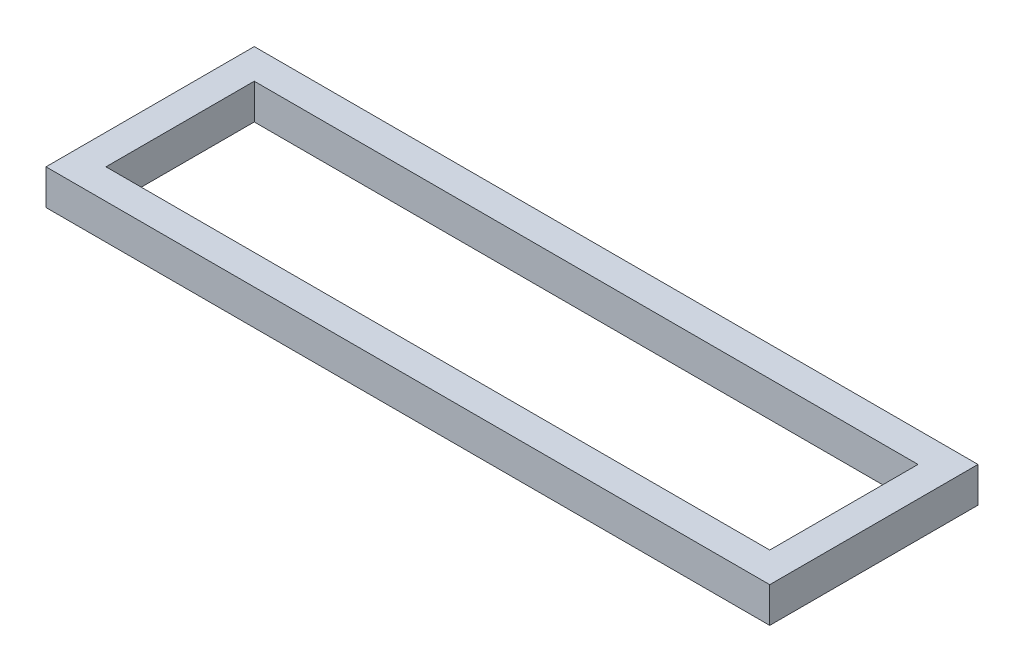
ISO-10303-21;
HEADER;
FILE_DESCRIPTION(('STEP AP214'),'2;1');
FILE_NAME('part.step','',(''),(''),'','','');
FILE_SCHEMA(('AUTOMOTIVE_DESIGN { 1 0 10303 214 1 1 1 1 }'));
ENDSEC;
DATA;
#1=APPLICATION_CONTEXT('core data for automotive mechanical design processes');
#2=APPLICATION_PROTOCOL_DEFINITION('international standard','automotive_design',2000,#1);
#3=PRODUCT_CONTEXT('',#1,'mechanical');
#4=PRODUCT('Part','Part','',(#3));
#5=PRODUCT_RELATED_PRODUCT_CATEGORY('part','',(#4));
#6=PRODUCT_DEFINITION_FORMATION('','',#4);
#7=PRODUCT_DEFINITION_CONTEXT('part definition',#1,'design');
#8=PRODUCT_DEFINITION('design','',#6,#7);
#9=PRODUCT_DEFINITION_SHAPE('','',#8);
#10=(LENGTH_UNIT() NAMED_UNIT(*) SI_UNIT(.MILLI.,.METRE.));
#11=(NAMED_UNIT(*) PLANE_ANGLE_UNIT() SI_UNIT($,.RADIAN.));
#12=(NAMED_UNIT(*) SI_UNIT($,.STERADIAN.) SOLID_ANGLE_UNIT());
#13=UNCERTAINTY_MEASURE_WITH_UNIT(LENGTH_MEASURE(1.E-05),#10,'distance_accuracy_value','');
#14=(GEOMETRIC_REPRESENTATION_CONTEXT(3) GLOBAL_UNCERTAINTY_ASSIGNED_CONTEXT((#13)) GLOBAL_UNIT_ASSIGNED_CONTEXT((#10,
#11,#12)) REPRESENTATION_CONTEXT('',''));
#15=CARTESIAN_POINT('',(0.,0.,0.));
#16=DIRECTION('',(0.,0.,1.));
#17=DIRECTION('',(1.,0.,0.));
#18=AXIS2_PLACEMENT_3D('',#15,#16,#17);
#19=CARTESIAN_POINT('',(-488.125,47.625,0.));
#20=DIRECTION('',(-1.,0.,0.));
#21=DIRECTION('',(0.,0.,1.));
#22=AXIS2_PLACEMENT_3D('',#19,#20,#21);
#23=PLANE('',#22);
#24=DIRECTION('',(0.,0.,-1.));
#25=VECTOR('',#24,1.);
#26=CARTESIAN_POINT('',(-488.125,0.,0.));
#27=LINE('',#26,#25);
#28=CARTESIAN_POINT('',(-488.125,0.,140.4625));
#29=VERTEX_POINT('',#28);
#30=CARTESIAN_POINT('',(-488.125,0.,-140.4625));
#31=VERTEX_POINT('',#30);
#32=EDGE_CURVE('E150',#29,#31,#27,.T.);
#33=ORIENTED_EDGE('',*,*,#32,.F.);
#34=DIRECTION('',(0.,-1.,0.));
#35=VECTOR('',#34,1.);
#36=CARTESIAN_POINT('',(-488.125,47.625,140.4625));
#37=LINE('',#36,#35);
#38=CARTESIAN_POINT('',(-488.125,47.625,140.4625));
#39=VERTEX_POINT('',#38);
#40=EDGE_CURVE('E11',#39,#29,#37,.T.);
#41=ORIENTED_EDGE('',*,*,#40,.F.);
#42=DIRECTION('',(0.,0.,-1.));
#43=VECTOR('',#42,1.);
#44=CARTESIAN_POINT('',(-488.125,47.625,0.));
#45=LINE('',#44,#43);
#46=CARTESIAN_POINT('',(-488.125,47.625,-140.4625));
#47=VERTEX_POINT('',#46);
#48=EDGE_CURVE('E121',#39,#47,#45,.T.);
#49=ORIENTED_EDGE('',*,*,#48,.T.);
#50=DIRECTION('',(0.,-1.,0.));
#51=VECTOR('',#50,1.);
#52=CARTESIAN_POINT('',(-488.125,47.625,-140.4625));
#53=LINE('',#52,#51);
#54=EDGE_CURVE('E55',#47,#31,#53,.T.);
#55=ORIENTED_EDGE('',*,*,#54,.T.);
#56=EDGE_LOOP('',(#33,#41,#49,#55));
#57=FACE_BOUND('',#56,.T.);
#58=ADVANCED_FACE('F36',(#57),#23,.T.);
#59=CARTESIAN_POINT('',(0.,47.625,140.4625));
#60=DIRECTION('',(0.,0.,-1.));
#61=DIRECTION('',(-1.,0.,0.));
#62=AXIS2_PLACEMENT_3D('',#59,#60,#61);
#63=PLANE('',#62);
#64=DIRECTION('',(1.,0.,0.));
#65=VECTOR('',#64,1.);
#66=CARTESIAN_POINT('',(0.,0.,140.4625));
#67=LINE('',#66,#65);
#68=CARTESIAN_POINT('',(488.125,0.,140.4625));
#69=VERTEX_POINT('',#68);
#70=EDGE_CURVE('E126',#29,#69,#67,.T.);
#71=ORIENTED_EDGE('',*,*,#70,.T.);
#72=DIRECTION('',(0.,-1.,0.));
#73=VECTOR('',#72,1.);
#74=CARTESIAN_POINT('',(488.125,47.625,140.4625));
#75=LINE('',#74,#73);
#76=CARTESIAN_POINT('',(488.125,47.625,140.4625));
#77=VERTEX_POINT('',#76);
#78=EDGE_CURVE('E46',#77,#69,#75,.T.);
#79=ORIENTED_EDGE('',*,*,#78,.F.);
#80=DIRECTION('',(1.,0.,0.));
#81=VECTOR('',#80,1.);
#82=CARTESIAN_POINT('',(0.,47.625,140.4625));
#83=LINE('',#82,#81);
#84=EDGE_CURVE('E116',#39,#77,#83,.T.);
#85=ORIENTED_EDGE('',*,*,#84,.F.);
#86=ORIENTED_EDGE('',*,*,#40,.T.);
#87=EDGE_LOOP('',(#71,#79,#85,#86));
#88=FACE_BOUND('',#87,.T.);
#89=ADVANCED_FACE('F124',(#88),#63,.F.);
#90=CARTESIAN_POINT('',(488.125,47.625,0.));
#91=DIRECTION('',(-1.,0.,0.));
#92=DIRECTION('',(0.,0.,1.));
#93=AXIS2_PLACEMENT_3D('',#90,#91,#92);
#94=PLANE('',#93);
#95=DIRECTION('',(0.,0.,-1.));
#96=VECTOR('',#95,1.);
#97=CARTESIAN_POINT('',(488.125,0.,0.));
#98=LINE('',#97,#96);
#99=CARTESIAN_POINT('',(488.125,0.,-140.4625));
#100=VERTEX_POINT('',#99);
#101=EDGE_CURVE('E147',#69,#100,#98,.T.);
#102=ORIENTED_EDGE('',*,*,#101,.T.);
#103=DIRECTION('',(0.,-1.,0.));
#104=VECTOR('',#103,1.);
#105=CARTESIAN_POINT('',(488.125,47.625,-140.4625));
#106=LINE('',#105,#104);
#107=CARTESIAN_POINT('',(488.125,47.625,-140.4625));
#108=VERTEX_POINT('',#107);
#109=EDGE_CURVE('E81',#108,#100,#106,.T.);
#110=ORIENTED_EDGE('',*,*,#109,.F.);
#111=DIRECTION('',(0.,0.,-1.));
#112=VECTOR('',#111,1.);
#113=CARTESIAN_POINT('',(488.125,47.625,0.));
#114=LINE('',#113,#112);
#115=EDGE_CURVE('E108',#77,#108,#114,.T.);
#116=ORIENTED_EDGE('',*,*,#115,.F.);
#117=ORIENTED_EDGE('',*,*,#78,.T.);
#118=EDGE_LOOP('',(#102,#110,#116,#117));
#119=FACE_BOUND('',#118,.T.);
#120=ADVANCED_FACE('F110',(#119),#94,.F.);
#121=CARTESIAN_POINT('',(447.675,47.625,0.));
#122=DIRECTION('',(-1.,0.,0.));
#123=DIRECTION('',(0.,0.,1.));
#124=AXIS2_PLACEMENT_3D('',#121,#122,#123);
#125=PLANE('',#124);
#126=DIRECTION('',(0.,0.,-1.));
#127=VECTOR('',#126,1.);
#128=CARTESIAN_POINT('',(447.675,0.,0.));
#129=LINE('',#128,#127);
#130=CARTESIAN_POINT('',(447.675,0.,100.0125));
#131=VERTEX_POINT('',#130);
#132=CARTESIAN_POINT('',(447.675,0.,-100.0125));
#133=VERTEX_POINT('',#132);
#134=EDGE_CURVE('E160',#131,#133,#129,.T.);
#135=ORIENTED_EDGE('',*,*,#134,.F.);
#136=DIRECTION('',(0.,-1.,0.));
#137=VECTOR('',#136,1.);
#138=CARTESIAN_POINT('',(447.675,47.625,100.0125));
#139=LINE('',#138,#137);
#140=CARTESIAN_POINT('',(447.675,47.625,100.0125));
#141=VERTEX_POINT('',#140);
#142=EDGE_CURVE('E40',#141,#131,#139,.T.);
#143=ORIENTED_EDGE('',*,*,#142,.F.);
#144=DIRECTION('',(0.,0.,-1.));
#145=VECTOR('',#144,1.);
#146=CARTESIAN_POINT('',(447.675,47.625,0.));
#147=LINE('',#146,#145);
#148=CARTESIAN_POINT('',(447.675,47.625,-100.0125));
#149=VERTEX_POINT('',#148);
#150=EDGE_CURVE('E146',#141,#149,#147,.T.);
#151=ORIENTED_EDGE('',*,*,#150,.T.);
#152=DIRECTION('',(0.,-1.,0.));
#153=VECTOR('',#152,1.);
#154=CARTESIAN_POINT('',(447.675,47.625,-100.0125));
#155=LINE('',#154,#153);
#156=EDGE_CURVE('E131',#149,#133,#155,.T.);
#157=ORIENTED_EDGE('',*,*,#156,.T.);
#158=EDGE_LOOP('',(#135,#143,#151,#157));
#159=FACE_BOUND('',#158,.T.);
#160=ADVANCED_FACE('F38',(#159),#125,.T.);
#161=CARTESIAN_POINT('',(0.,47.625,100.0125));
#162=DIRECTION('',(0.,0.,-1.));
#163=DIRECTION('',(-1.,0.,0.));
#164=AXIS2_PLACEMENT_3D('',#161,#162,#163);
#165=PLANE('',#164);
#166=DIRECTION('',(1.,0.,0.));
#167=VECTOR('',#166,1.);
#168=CARTESIAN_POINT('',(0.,0.,100.0125));
#169=LINE('',#168,#167);
#170=CARTESIAN_POINT('',(-447.675,0.,100.0125));
#171=VERTEX_POINT('',#170);
#172=EDGE_CURVE('E157',#171,#131,#169,.T.);
#173=ORIENTED_EDGE('',*,*,#172,.F.);
#174=DIRECTION('',(0.,-1.,0.));
#175=VECTOR('',#174,1.);
#176=CARTESIAN_POINT('',(-447.675,47.625,100.0125));
#177=LINE('',#176,#175);
#178=CARTESIAN_POINT('',(-447.675,47.625,100.0125));
#179=VERTEX_POINT('',#178);
#180=EDGE_CURVE('E135',#179,#171,#177,.T.);
#181=ORIENTED_EDGE('',*,*,#180,.F.);
#182=DIRECTION('',(1.,0.,0.));
#183=VECTOR('',#182,1.);
#184=CARTESIAN_POINT('',(0.,47.625,100.0125));
#185=LINE('',#184,#183);
#186=EDGE_CURVE('E169',#179,#141,#185,.T.);
#187=ORIENTED_EDGE('',*,*,#186,.T.);
#188=ORIENTED_EDGE('',*,*,#142,.T.);
#189=EDGE_LOOP('',(#173,#181,#187,#188));
#190=FACE_BOUND('',#189,.T.);
#191=ADVANCED_FACE('F175',(#190),#165,.T.);
#192=CARTESIAN_POINT('',(-447.675,47.625,0.));
#193=DIRECTION('',(-1.,0.,0.));
#194=DIRECTION('',(0.,0.,1.));
#195=AXIS2_PLACEMENT_3D('',#192,#193,#194);
#196=PLANE('',#195);
#197=DIRECTION('',(0.,0.,-1.));
#198=VECTOR('',#197,1.);
#199=CARTESIAN_POINT('',(-447.675,0.,0.));
#200=LINE('',#199,#198);
#201=CARTESIAN_POINT('',(-447.675,0.,-100.0125));
#202=VERTEX_POINT('',#201);
#203=EDGE_CURVE('E155',#171,#202,#200,.T.);
#204=ORIENTED_EDGE('',*,*,#203,.T.);
#205=DIRECTION('',(0.,-1.,0.));
#206=VECTOR('',#205,1.);
#207=CARTESIAN_POINT('',(-447.675,47.625,-100.0125));
#208=LINE('',#207,#206);
#209=CARTESIAN_POINT('',(-447.675,47.625,-100.0125));
#210=VERTEX_POINT('',#209);
#211=EDGE_CURVE('E133',#210,#202,#208,.T.);
#212=ORIENTED_EDGE('',*,*,#211,.F.);
#213=DIRECTION('',(0.,0.,-1.));
#214=VECTOR('',#213,1.);
#215=CARTESIAN_POINT('',(-447.675,47.625,0.));
#216=LINE('',#215,#214);
#217=EDGE_CURVE('E167',#179,#210,#216,.T.);
#218=ORIENTED_EDGE('',*,*,#217,.F.);
#219=ORIENTED_EDGE('',*,*,#180,.T.);
#220=EDGE_LOOP('',(#204,#212,#218,#219));
#221=FACE_BOUND('',#220,.T.);
#222=ADVANCED_FACE('F177',(#221),#196,.F.);
#223=CARTESIAN_POINT('',(0.,47.625,-100.0125));
#224=DIRECTION('',(0.,0.,-1.));
#225=DIRECTION('',(-1.,0.,0.));
#226=AXIS2_PLACEMENT_3D('',#223,#224,#225);
#227=PLANE('',#226);
#228=DIRECTION('',(1.,0.,0.));
#229=VECTOR('',#228,1.);
#230=CARTESIAN_POINT('',(0.,0.,-100.0125));
#231=LINE('',#230,#229);
#232=EDGE_CURVE('E152',#202,#133,#231,.T.);
#233=ORIENTED_EDGE('',*,*,#232,.T.);
#234=ORIENTED_EDGE('',*,*,#156,.F.);
#235=DIRECTION('',(1.,0.,0.));
#236=VECTOR('',#235,1.);
#237=CARTESIAN_POINT('',(0.,47.625,-100.0125));
#238=LINE('',#237,#236);
#239=EDGE_CURVE('E165',#210,#149,#238,.T.);
#240=ORIENTED_EDGE('',*,*,#239,.F.);
#241=ORIENTED_EDGE('',*,*,#211,.T.);
#242=EDGE_LOOP('',(#233,#234,#240,#241));
#243=FACE_BOUND('',#242,.T.);
#244=ADVANCED_FACE('F180',(#243),#227,.F.);
#245=CARTESIAN_POINT('',(0.,47.625,-140.4625));
#246=DIRECTION('',(0.,0.,-1.));
#247=DIRECTION('',(-1.,0.,0.));
#248=AXIS2_PLACEMENT_3D('',#245,#246,#247);
#249=PLANE('',#248);
#250=DIRECTION('',(1.,0.,0.));
#251=VECTOR('',#250,1.);
#252=CARTESIAN_POINT('',(0.,0.,-140.4625));
#253=LINE('',#252,#251);
#254=EDGE_CURVE('E143',#31,#100,#253,.T.);
#255=ORIENTED_EDGE('',*,*,#254,.F.);
#256=ORIENTED_EDGE('',*,*,#54,.F.);
#257=DIRECTION('',(1.,0.,0.));
#258=VECTOR('',#257,1.);
#259=CARTESIAN_POINT('',(0.,47.625,-140.4625));
#260=LINE('',#259,#258);
#261=EDGE_CURVE('E115',#47,#108,#260,.T.);
#262=ORIENTED_EDGE('',*,*,#261,.T.);
#263=ORIENTED_EDGE('',*,*,#109,.T.);
#264=EDGE_LOOP('',(#255,#256,#262,#263));
#265=FACE_BOUND('',#264,.T.);
#266=ADVANCED_FACE('F186',(#265),#249,.T.);
#267=CARTESIAN_POINT('',(0.,47.625,0.));
#268=DIRECTION('',(0.,1.,0.));
#269=DIRECTION('',(0.,0.,1.));
#270=AXIS2_PLACEMENT_3D('',#267,#268,#269);
#271=PLANE('',#270);
#272=ORIENTED_EDGE('',*,*,#150,.F.);
#273=ORIENTED_EDGE('',*,*,#186,.F.);
#274=ORIENTED_EDGE('',*,*,#217,.T.);
#275=ORIENTED_EDGE('',*,*,#239,.T.);
#276=EDGE_LOOP('',(#272,#273,#274,#275));
#277=FACE_BOUND('',#276,.T.);
#278=ORIENTED_EDGE('',*,*,#48,.F.);
#279=ORIENTED_EDGE('',*,*,#84,.T.);
#280=ORIENTED_EDGE('',*,*,#115,.T.);
#281=ORIENTED_EDGE('',*,*,#261,.F.);
#282=EDGE_LOOP('',(#278,#279,#280,#281));
#283=FACE_BOUND('',#282,.T.);
#284=ADVANCED_FACE('F120',(#277,#283),#271,.T.);
#285=CARTESIAN_POINT('',(0.,0.,0.));
#286=DIRECTION('',(0.,1.,0.));
#287=DIRECTION('',(0.,0.,1.));
#288=AXIS2_PLACEMENT_3D('',#285,#286,#287);
#289=PLANE('',#288);
#290=ORIENTED_EDGE('',*,*,#134,.T.);
#291=ORIENTED_EDGE('',*,*,#232,.F.);
#292=ORIENTED_EDGE('',*,*,#203,.F.);
#293=ORIENTED_EDGE('',*,*,#172,.T.);
#294=EDGE_LOOP('',(#290,#291,#292,#293));
#295=FACE_BOUND('',#294,.T.);
#296=ORIENTED_EDGE('',*,*,#32,.T.);
#297=ORIENTED_EDGE('',*,*,#254,.T.);
#298=ORIENTED_EDGE('',*,*,#101,.F.);
#299=ORIENTED_EDGE('',*,*,#70,.F.);
#300=EDGE_LOOP('',(#296,#297,#298,#299));
#301=FACE_BOUND('',#300,.T.);
#302=ADVANCED_FACE('F182',(#295,#301),#289,.F.);
#303=CLOSED_SHELL('',(#58,#89,#120,#160,#191,#222,#244,#266,#284,#302));
#304=MANIFOLD_SOLID_BREP('B2',#303);
#305=ADVANCED_BREP_SHAPE_REPRESENTATION('',(#18,#304),#14);
#306=SHAPE_DEFINITION_REPRESENTATION(#9,#305);
ENDSEC;
END-ISO-10303-21;
